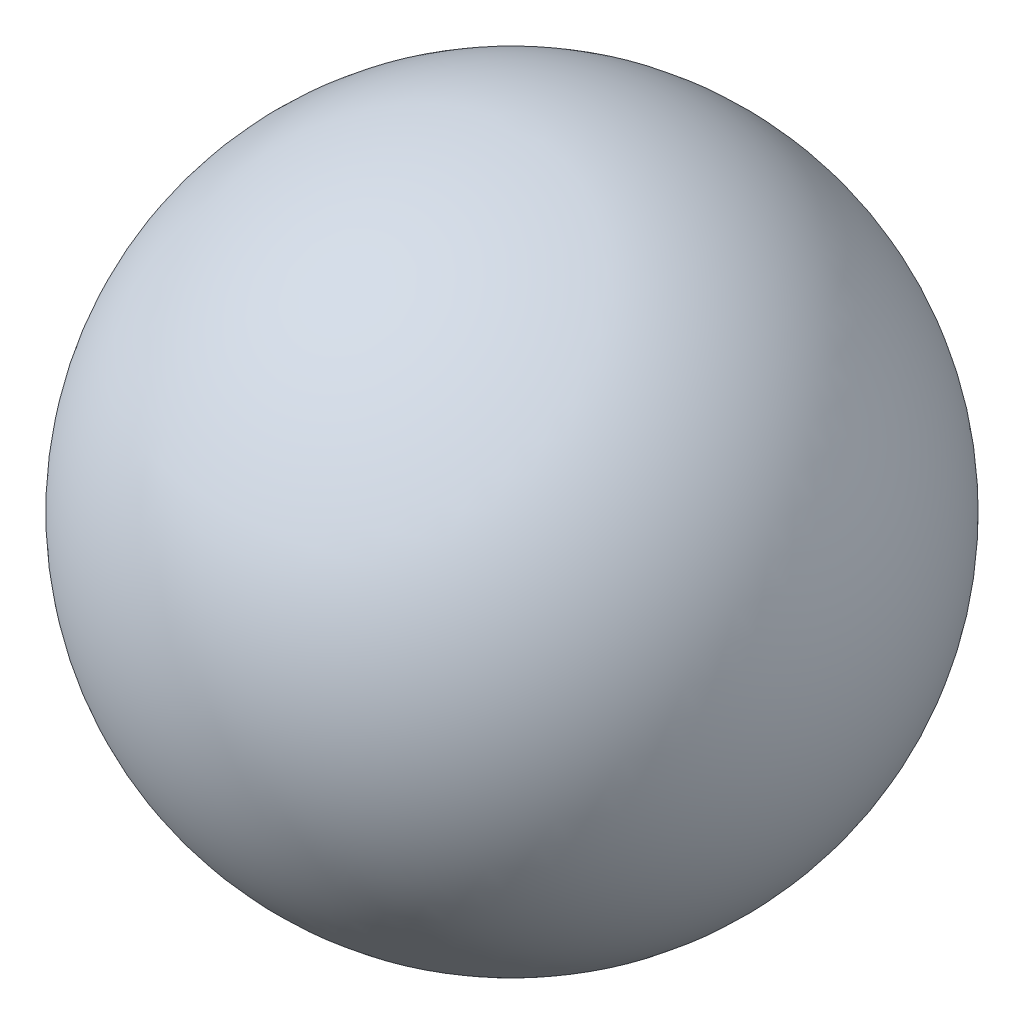
ISO-10303-21;
HEADER;
FILE_DESCRIPTION(('STEP AP214'),'2;1');
FILE_NAME('part.step','',(''),(''),'','','');
FILE_SCHEMA(('AUTOMOTIVE_DESIGN { 1 0 10303 214 1 1 1 1 }'));
ENDSEC;
DATA;
#1=APPLICATION_CONTEXT('core data for automotive mechanical design processes');
#2=APPLICATION_PROTOCOL_DEFINITION('international standard','automotive_design',2000,#1);
#3=PRODUCT_CONTEXT('',#1,'mechanical');
#4=PRODUCT('Part','Part','',(#3));
#5=PRODUCT_RELATED_PRODUCT_CATEGORY('part','',(#4));
#6=PRODUCT_DEFINITION_FORMATION('','',#4);
#7=PRODUCT_DEFINITION_CONTEXT('part definition',#1,'design');
#8=PRODUCT_DEFINITION('design','',#6,#7);
#9=PRODUCT_DEFINITION_SHAPE('','',#8);
#10=(LENGTH_UNIT() NAMED_UNIT(*) SI_UNIT(.MILLI.,.METRE.));
#11=(NAMED_UNIT(*) PLANE_ANGLE_UNIT() SI_UNIT($,.RADIAN.));
#12=(NAMED_UNIT(*) SI_UNIT($,.STERADIAN.) SOLID_ANGLE_UNIT());
#13=UNCERTAINTY_MEASURE_WITH_UNIT(LENGTH_MEASURE(1.E-05),#10,'distance_accuracy_value','');
#14=(GEOMETRIC_REPRESENTATION_CONTEXT(3) GLOBAL_UNCERTAINTY_ASSIGNED_CONTEXT((#13)) GLOBAL_UNIT_ASSIGNED_CONTEXT((#10,
#11,#12)) REPRESENTATION_CONTEXT('',''));
#15=CARTESIAN_POINT('',(0.,0.,0.));
#16=DIRECTION('',(0.,0.,1.));
#17=DIRECTION('',(1.,0.,0.));
#18=AXIS2_PLACEMENT_3D('',#15,#16,#17);
#19=CARTESIAN_POINT('',(0.,9.525,0.));
#20=DIRECTION('',(0.,-1.,0.));
#21=DIRECTION('',(-1.,0.,0.));
#22=AXIS2_PLACEMENT_3D('',#19,#20,#21);
#23=SPHERICAL_SURFACE('',#22,9.525);
#24=CARTESIAN_POINT('',(0.,0.,0.));
#25=VERTEX_POINT('',#24);
#26=VERTEX_LOOP('',#25);
#27=FACE_BOUND('',#26,.T.);
#28=ADVANCED_FACE('F29',(#27),#23,.T.);
#29=CLOSED_SHELL('',(#28));
#30=MANIFOLD_SOLID_BREP('B2',#29);
#31=ADVANCED_BREP_SHAPE_REPRESENTATION('',(#18,#30),#14);
#32=SHAPE_DEFINITION_REPRESENTATION(#9,#31);
ENDSEC;
END-ISO-10303-21;
